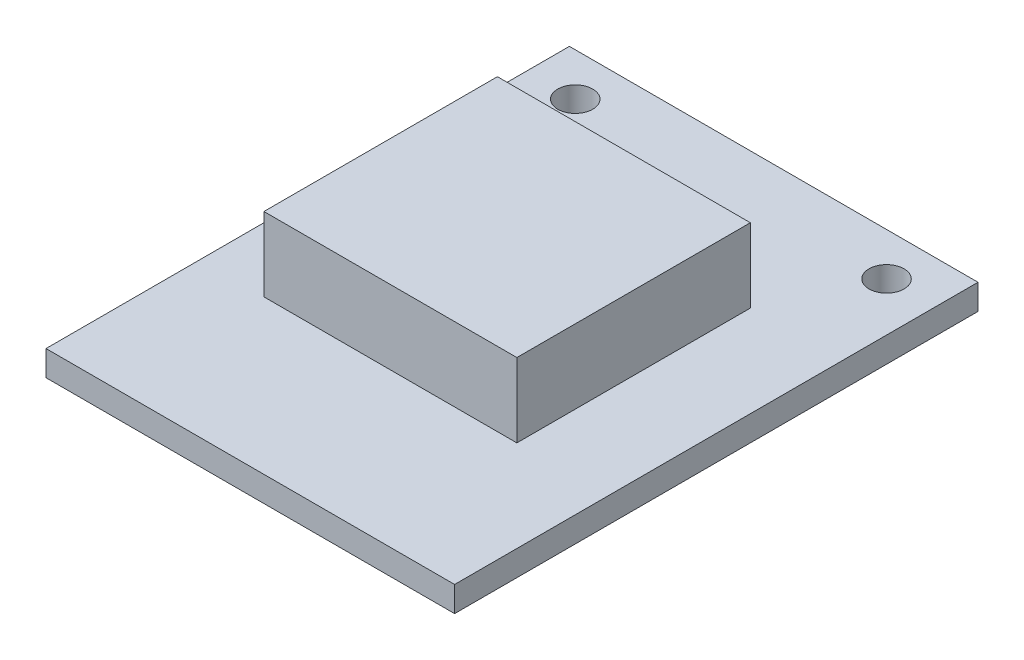
ISO-10303-21;
HEADER;
FILE_DESCRIPTION(('STEP AP214'),'2;1');
FILE_NAME('part.step','',(''),(''),'','','');
FILE_SCHEMA(('AUTOMOTIVE_DESIGN { 1 0 10303 214 1 1 1 1 }'));
ENDSEC;
DATA;
#1=APPLICATION_CONTEXT('core data for automotive mechanical design processes');
#2=APPLICATION_PROTOCOL_DEFINITION('international standard','automotive_design',2000,#1);
#3=PRODUCT_CONTEXT('',#1,'mechanical');
#4=PRODUCT('Part','Part','',(#3));
#5=PRODUCT_RELATED_PRODUCT_CATEGORY('part','',(#4));
#6=PRODUCT_DEFINITION_FORMATION('','',#4);
#7=PRODUCT_DEFINITION_CONTEXT('part definition',#1,'design');
#8=PRODUCT_DEFINITION('design','',#6,#7);
#9=PRODUCT_DEFINITION_SHAPE('','',#8);
#10=(LENGTH_UNIT() NAMED_UNIT(*) SI_UNIT(.MILLI.,.METRE.));
#11=(NAMED_UNIT(*) PLANE_ANGLE_UNIT() SI_UNIT($,.RADIAN.));
#12=(NAMED_UNIT(*) SI_UNIT($,.STERADIAN.) SOLID_ANGLE_UNIT());
#13=UNCERTAINTY_MEASURE_WITH_UNIT(LENGTH_MEASURE(1.E-05),#10,'distance_accuracy_value','');
#14=(GEOMETRIC_REPRESENTATION_CONTEXT(3) GLOBAL_UNCERTAINTY_ASSIGNED_CONTEXT((#13)) GLOBAL_UNIT_ASSIGNED_CONTEXT((#10,
#11,#12)) REPRESENTATION_CONTEXT('',''));
#15=CARTESIAN_POINT('',(0.,0.,0.));
#16=DIRECTION('',(0.,0.,1.));
#17=DIRECTION('',(1.,0.,0.));
#18=AXIS2_PLACEMENT_3D('',#15,#16,#17);
#19=CARTESIAN_POINT('',(0.,1.651,0.));
#20=DIRECTION('',(0.,1.,0.));
#21=DIRECTION('',(0.,0.,1.));
#22=AXIS2_PLACEMENT_3D('',#19,#20,#21);
#23=PLANE('',#22);
#24=DIRECTION('',(0.,0.,1.));
#25=VECTOR('',#24,1.);
#26=CARTESIAN_POINT('',(17.526,1.651,0.));
#27=LINE('',#26,#25);
#28=CARTESIAN_POINT('',(17.526,1.651,6.096));
#29=VERTEX_POINT('',#28);
#30=CARTESIAN_POINT('',(17.526,1.651,21.336));
#31=VERTEX_POINT('',#30);
#32=EDGE_CURVE('E132',#29,#31,#27,.T.);
#33=ORIENTED_EDGE('',*,*,#32,.T.);
#34=DIRECTION('',(1.,0.,0.));
#35=VECTOR('',#34,1.);
#36=CARTESIAN_POINT('',(0.,1.651,21.336));
#37=LINE('',#36,#35);
#38=CARTESIAN_POINT('',(1.016,1.651,21.336));
#39=VERTEX_POINT('',#38);
#40=EDGE_CURVE('E146',#39,#31,#37,.T.);
#41=ORIENTED_EDGE('',*,*,#40,.F.);
#42=DIRECTION('',(0.,0.,1.));
#43=VECTOR('',#42,1.);
#44=CARTESIAN_POINT('',(1.016,1.651,0.));
#45=LINE('',#44,#43);
#46=CARTESIAN_POINT('',(1.016,1.651,6.096));
#47=VERTEX_POINT('',#46);
#48=EDGE_CURVE('E159',#47,#39,#45,.T.);
#49=ORIENTED_EDGE('',*,*,#48,.F.);
#50=DIRECTION('',(1.,0.,0.));
#51=VECTOR('',#50,1.);
#52=CARTESIAN_POINT('',(0.,1.651,6.096));
#53=LINE('',#52,#51);
#54=EDGE_CURVE('E157',#47,#29,#53,.T.);
#55=ORIENTED_EDGE('',*,*,#54,.T.);
#56=EDGE_LOOP('',(#33,#41,#49,#55));
#57=FACE_BOUND('',#56,.T.);
#58=CARTESIAN_POINT('',(0.,1.651,0.));
#59=DIRECTION('',(0.,1.,0.));
#60=DIRECTION('',(0.,0.,1.));
#61=AXIS2_PLACEMENT_3D('',#58,#59,#60);
#62=CIRCLE('',#61,1.143);
#63=CARTESIAN_POINT('',(0.,1.651,1.143));
#64=VERTEX_POINT('',#63);
#65=EDGE_CURVE('E171',#64,#64,#62,.T.);
#66=ORIENTED_EDGE('',*,*,#65,.F.);
#67=EDGE_LOOP('',(#66));
#68=FACE_BOUND('',#67,.T.);
#69=DIRECTION('',(0.,0.,1.));
#70=VECTOR('',#69,1.);
#71=CARTESIAN_POINT('',(-3.175,1.651,-2.794));
#72=LINE('',#71,#70);
#73=CARTESIAN_POINT('',(-3.175,1.651,-2.794));
#74=VERTEX_POINT('',#73);
#75=CARTESIAN_POINT('',(-3.17499999999999,1.651,31.369));
#76=VERTEX_POINT('',#75);
#77=EDGE_CURVE('E177',#74,#76,#72,.T.);
#78=ORIENTED_EDGE('',*,*,#77,.T.);
#79=DIRECTION('',(1.,0.,0.));
#80=VECTOR('',#79,1.);
#81=CARTESIAN_POINT('',(-3.17499999999999,1.651,31.369));
#82=LINE('',#81,#80);
#83=CARTESIAN_POINT('',(23.495,1.651,31.369));
#84=VERTEX_POINT('',#83);
#85=EDGE_CURVE('E103',#76,#84,#82,.T.);
#86=ORIENTED_EDGE('',*,*,#85,.T.);
#87=DIRECTION('',(0.,0.,-1.));
#88=VECTOR('',#87,1.);
#89=CARTESIAN_POINT('',(23.495,1.651,-2.794));
#90=LINE('',#89,#88);
#91=CARTESIAN_POINT('',(23.495,1.651,-2.794));
#92=VERTEX_POINT('',#91);
#93=EDGE_CURVE('E180',#84,#92,#90,.T.);
#94=ORIENTED_EDGE('',*,*,#93,.T.);
#95=DIRECTION('',(-1.,0.,0.));
#96=VECTOR('',#95,1.);
#97=CARTESIAN_POINT('',(-3.175,1.651,-2.794));
#98=LINE('',#97,#96);
#99=EDGE_CURVE('E75',#92,#74,#98,.T.);
#100=ORIENTED_EDGE('',*,*,#99,.T.);
#101=EDGE_LOOP('',(#78,#86,#94,#100));
#102=FACE_BOUND('',#101,.T.);
#103=CARTESIAN_POINT('',(20.32,1.651,0.));
#104=DIRECTION('',(0.,1.,0.));
#105=DIRECTION('',(0.,0.,1.));
#106=AXIS2_PLACEMENT_3D('',#103,#104,#105);
#107=CIRCLE('',#106,1.143);
#108=CARTESIAN_POINT('',(20.32,1.651,1.143));
#109=VERTEX_POINT('',#108);
#110=EDGE_CURVE('E165',#109,#109,#107,.T.);
#111=ORIENTED_EDGE('',*,*,#110,.F.);
#112=EDGE_LOOP('',(#111));
#113=FACE_BOUND('',#112,.T.);
#114=ADVANCED_FACE('F51',(#57,#68,#102,#113),#23,.T.);
#115=CARTESIAN_POINT('',(0.,0.,0.));
#116=DIRECTION('',(0.,1.,0.));
#117=DIRECTION('',(0.,0.,1.));
#118=AXIS2_PLACEMENT_3D('',#115,#116,#117);
#119=PLANE('',#118);
#120=DIRECTION('',(0.,0.,1.));
#121=VECTOR('',#120,1.);
#122=CARTESIAN_POINT('',(-3.175,0.,-2.794));
#123=LINE('',#122,#121);
#124=CARTESIAN_POINT('',(-3.175,0.,-2.794));
#125=VERTEX_POINT('',#124);
#126=CARTESIAN_POINT('',(-3.17499999999999,0.,31.369));
#127=VERTEX_POINT('',#126);
#128=EDGE_CURVE('E174',#125,#127,#123,.T.);
#129=ORIENTED_EDGE('',*,*,#128,.F.);
#130=DIRECTION('',(-1.,0.,0.));
#131=VECTOR('',#130,1.);
#132=CARTESIAN_POINT('',(-3.175,0.,-2.794));
#133=LINE('',#132,#131);
#134=CARTESIAN_POINT('',(23.495,0.,-2.794));
#135=VERTEX_POINT('',#134);
#136=EDGE_CURVE('E96',#135,#125,#133,.T.);
#137=ORIENTED_EDGE('',*,*,#136,.F.);
#138=DIRECTION('',(0.,0.,-1.));
#139=VECTOR('',#138,1.);
#140=CARTESIAN_POINT('',(23.495,0.,-2.794));
#141=LINE('',#140,#139);
#142=CARTESIAN_POINT('',(23.495,0.,31.369));
#143=VERTEX_POINT('',#142);
#144=EDGE_CURVE('E188',#143,#135,#141,.T.);
#145=ORIENTED_EDGE('',*,*,#144,.F.);
#146=DIRECTION('',(1.,0.,0.));
#147=VECTOR('',#146,1.);
#148=CARTESIAN_POINT('',(-3.17499999999999,0.,31.369));
#149=LINE('',#148,#147);
#150=EDGE_CURVE('E186',#127,#143,#149,.T.);
#151=ORIENTED_EDGE('',*,*,#150,.F.);
#152=EDGE_LOOP('',(#129,#137,#145,#151));
#153=FACE_BOUND('',#152,.T.);
#154=CARTESIAN_POINT('',(0.,0.,0.));
#155=DIRECTION('',(0.,1.,0.));
#156=DIRECTION('',(0.,0.,1.));
#157=AXIS2_PLACEMENT_3D('',#154,#155,#156);
#158=CIRCLE('',#157,1.143);
#159=CARTESIAN_POINT('',(0.,0.,1.143));
#160=VERTEX_POINT('',#159);
#161=EDGE_CURVE('E168',#160,#160,#158,.T.);
#162=ORIENTED_EDGE('',*,*,#161,.T.);
#163=EDGE_LOOP('',(#162));
#164=FACE_BOUND('',#163,.T.);
#165=CARTESIAN_POINT('',(20.32,0.,0.));
#166=DIRECTION('',(0.,1.,0.));
#167=DIRECTION('',(0.,0.,1.));
#168=AXIS2_PLACEMENT_3D('',#165,#166,#167);
#169=CIRCLE('',#168,1.143);
#170=CARTESIAN_POINT('',(20.32,0.,1.143));
#171=VERTEX_POINT('',#170);
#172=EDGE_CURVE('E137',#171,#171,#169,.T.);
#173=ORIENTED_EDGE('',*,*,#172,.T.);
#174=EDGE_LOOP('',(#173));
#175=FACE_BOUND('',#174,.T.);
#176=ADVANCED_FACE('F201',(#153,#164,#175),#119,.F.);
#177=CARTESIAN_POINT('',(-3.175,1.651,-2.794));
#178=DIRECTION('',(1.,0.,0.));
#179=DIRECTION('',(0.,0.,-1.));
#180=AXIS2_PLACEMENT_3D('',#177,#178,#179);
#181=PLANE('',#180);
#182=ORIENTED_EDGE('',*,*,#128,.T.);
#183=DIRECTION('',(0.,-1.,0.));
#184=VECTOR('',#183,1.);
#185=CARTESIAN_POINT('',(-3.17499999999999,1.651,31.369));
#186=LINE('',#185,#184);
#187=EDGE_CURVE('E11',#76,#127,#186,.T.);
#188=ORIENTED_EDGE('',*,*,#187,.F.);
#189=ORIENTED_EDGE('',*,*,#77,.F.);
#190=DIRECTION('',(0.,-1.,0.));
#191=VECTOR('',#190,1.);
#192=CARTESIAN_POINT('',(-3.175,1.651,-2.794));
#193=LINE('',#192,#191);
#194=EDGE_CURVE('E183',#74,#125,#193,.T.);
#195=ORIENTED_EDGE('',*,*,#194,.T.);
#196=EDGE_LOOP('',(#182,#188,#189,#195));
#197=FACE_BOUND('',#196,.T.);
#198=ADVANCED_FACE('F53',(#197),#181,.F.);
#199=CARTESIAN_POINT('',(-3.17499999999999,1.651,31.369));
#200=DIRECTION('',(0.,0.,-1.));
#201=DIRECTION('',(-1.,0.,0.));
#202=AXIS2_PLACEMENT_3D('',#199,#200,#201);
#203=PLANE('',#202);
#204=ORIENTED_EDGE('',*,*,#150,.T.);
#205=DIRECTION('',(0.,-1.,0.));
#206=VECTOR('',#205,1.);
#207=CARTESIAN_POINT('',(23.495,1.651,31.369));
#208=LINE('',#207,#206);
#209=EDGE_CURVE('E59',#84,#143,#208,.T.);
#210=ORIENTED_EDGE('',*,*,#209,.F.);
#211=ORIENTED_EDGE('',*,*,#85,.F.);
#212=ORIENTED_EDGE('',*,*,#187,.T.);
#213=EDGE_LOOP('',(#204,#210,#211,#212));
#214=FACE_BOUND('',#213,.T.);
#215=ADVANCED_FACE('F217',(#214),#203,.F.);
#216=CARTESIAN_POINT('',(23.495,1.651,-2.794));
#217=DIRECTION('',(-1.,0.,0.));
#218=DIRECTION('',(0.,0.,1.));
#219=AXIS2_PLACEMENT_3D('',#216,#217,#218);
#220=PLANE('',#219);
#221=ORIENTED_EDGE('',*,*,#144,.T.);
#222=DIRECTION('',(0.,-1.,0.));
#223=VECTOR('',#222,1.);
#224=CARTESIAN_POINT('',(23.495,1.651,-2.794));
#225=LINE('',#224,#223);
#226=EDGE_CURVE('E192',#92,#135,#225,.T.);
#227=ORIENTED_EDGE('',*,*,#226,.F.);
#228=ORIENTED_EDGE('',*,*,#93,.F.);
#229=ORIENTED_EDGE('',*,*,#209,.T.);
#230=EDGE_LOOP('',(#221,#227,#228,#229));
#231=FACE_BOUND('',#230,.T.);
#232=ADVANCED_FACE('F197',(#231),#220,.F.);
#233=CARTESIAN_POINT('',(-3.175,1.651,-2.794));
#234=DIRECTION('',(0.,0.,1.));
#235=DIRECTION('',(1.,0.,0.));
#236=AXIS2_PLACEMENT_3D('',#233,#234,#235);
#237=PLANE('',#236);
#238=ORIENTED_EDGE('',*,*,#136,.T.);
#239=ORIENTED_EDGE('',*,*,#194,.F.);
#240=ORIENTED_EDGE('',*,*,#99,.F.);
#241=ORIENTED_EDGE('',*,*,#226,.T.);
#242=EDGE_LOOP('',(#238,#239,#240,#241));
#243=FACE_BOUND('',#242,.T.);
#244=ADVANCED_FACE('F206',(#243),#237,.F.);
#245=CARTESIAN_POINT('',(0.,1.651,0.));
#246=DIRECTION('',(0.,-1.,0.));
#247=DIRECTION('',(0.,0.,-1.));
#248=AXIS2_PLACEMENT_3D('',#245,#246,#247);
#249=CYLINDRICAL_SURFACE('',#248,1.143);
#250=ORIENTED_EDGE('',*,*,#65,.T.);
#251=EDGE_LOOP('',(#250));
#252=FACE_BOUND('',#251,.T.);
#253=ORIENTED_EDGE('',*,*,#161,.F.);
#254=EDGE_LOOP('',(#253));
#255=FACE_BOUND('',#254,.T.);
#256=ADVANCED_FACE('F208',(#252,#255),#249,.F.);
#257=CARTESIAN_POINT('',(20.32,1.651,0.));
#258=DIRECTION('',(0.,-1.,0.));
#259=DIRECTION('',(0.,0.,-1.));
#260=AXIS2_PLACEMENT_3D('',#257,#258,#259);
#261=CYLINDRICAL_SURFACE('',#260,1.143);
#262=ORIENTED_EDGE('',*,*,#110,.T.);
#263=EDGE_LOOP('',(#262));
#264=FACE_BOUND('',#263,.T.);
#265=ORIENTED_EDGE('',*,*,#172,.F.);
#266=EDGE_LOOP('',(#265));
#267=FACE_BOUND('',#266,.T.);
#268=ADVANCED_FACE('F214',(#264,#267),#261,.F.);
#269=CARTESIAN_POINT('',(17.526,6.477,0.));
#270=DIRECTION('',(1.,0.,0.));
#271=DIRECTION('',(0.,0.,-1.));
#272=AXIS2_PLACEMENT_3D('',#269,#270,#271);
#273=PLANE('',#272);
#274=ORIENTED_EDGE('',*,*,#32,.F.);
#275=DIRECTION('',(0.,-1.,0.));
#276=VECTOR('',#275,1.);
#277=CARTESIAN_POINT('',(17.526,6.477,6.096));
#278=LINE('',#277,#276);
#279=CARTESIAN_POINT('',(17.526,6.477,6.096));
#280=VERTEX_POINT('',#279);
#281=EDGE_CURVE('E127',#280,#29,#278,.T.);
#282=ORIENTED_EDGE('',*,*,#281,.F.);
#283=DIRECTION('',(0.,0.,1.));
#284=VECTOR('',#283,1.);
#285=CARTESIAN_POINT('',(17.526,6.477,0.));
#286=LINE('',#285,#284);
#287=CARTESIAN_POINT('',(17.526,6.477,21.336));
#288=VERTEX_POINT('',#287);
#289=EDGE_CURVE('E130',#280,#288,#286,.T.);
#290=ORIENTED_EDGE('',*,*,#289,.T.);
#291=DIRECTION('',(0.,-1.,0.));
#292=VECTOR('',#291,1.);
#293=CARTESIAN_POINT('',(17.526,6.477,21.336));
#294=LINE('',#293,#292);
#295=EDGE_CURVE('E155',#288,#31,#294,.T.);
#296=ORIENTED_EDGE('',*,*,#295,.T.);
#297=EDGE_LOOP('',(#274,#282,#290,#296));
#298=FACE_BOUND('',#297,.T.);
#299=ADVANCED_FACE('F129',(#298),#273,.T.);
#300=CARTESIAN_POINT('',(0.,6.477,6.096));
#301=DIRECTION('',(0.,0.,-1.));
#302=DIRECTION('',(-1.,0.,0.));
#303=AXIS2_PLACEMENT_3D('',#300,#301,#302);
#304=PLANE('',#303);
#305=ORIENTED_EDGE('',*,*,#54,.F.);
#306=DIRECTION('',(0.,-1.,0.));
#307=VECTOR('',#306,1.);
#308=CARTESIAN_POINT('',(1.016,6.477,6.096));
#309=LINE('',#308,#307);
#310=CARTESIAN_POINT('',(1.016,6.477,6.096));
#311=VERTEX_POINT('',#310);
#312=EDGE_CURVE('E138',#311,#47,#309,.T.);
#313=ORIENTED_EDGE('',*,*,#312,.F.);
#314=DIRECTION('',(1.,0.,0.));
#315=VECTOR('',#314,1.);
#316=CARTESIAN_POINT('',(0.,6.477,6.096));
#317=LINE('',#316,#315);
#318=EDGE_CURVE('E143',#311,#280,#317,.T.);
#319=ORIENTED_EDGE('',*,*,#318,.T.);
#320=ORIENTED_EDGE('',*,*,#281,.T.);
#321=EDGE_LOOP('',(#305,#313,#319,#320));
#322=FACE_BOUND('',#321,.T.);
#323=ADVANCED_FACE('F148',(#322),#304,.T.);
#324=CARTESIAN_POINT('',(1.016,6.477,0.));
#325=DIRECTION('',(1.,0.,0.));
#326=DIRECTION('',(0.,0.,-1.));
#327=AXIS2_PLACEMENT_3D('',#324,#325,#326);
#328=PLANE('',#327);
#329=ORIENTED_EDGE('',*,*,#48,.T.);
#330=DIRECTION('',(0.,-1.,0.));
#331=VECTOR('',#330,1.);
#332=CARTESIAN_POINT('',(1.016,6.477,21.336));
#333=LINE('',#332,#331);
#334=CARTESIAN_POINT('',(1.016,6.477,21.336));
#335=VERTEX_POINT('',#334);
#336=EDGE_CURVE('E66',#335,#39,#333,.T.);
#337=ORIENTED_EDGE('',*,*,#336,.F.);
#338=DIRECTION('',(0.,0.,1.));
#339=VECTOR('',#338,1.);
#340=CARTESIAN_POINT('',(1.016,6.477,0.));
#341=LINE('',#340,#339);
#342=EDGE_CURVE('E150',#311,#335,#341,.T.);
#343=ORIENTED_EDGE('',*,*,#342,.F.);
#344=ORIENTED_EDGE('',*,*,#312,.T.);
#345=EDGE_LOOP('',(#329,#337,#343,#344));
#346=FACE_BOUND('',#345,.T.);
#347=ADVANCED_FACE('F235',(#346),#328,.F.);
#348=CARTESIAN_POINT('',(0.,6.477,21.336));
#349=DIRECTION('',(0.,0.,-1.));
#350=DIRECTION('',(-1.,0.,0.));
#351=AXIS2_PLACEMENT_3D('',#348,#349,#350);
#352=PLANE('',#351);
#353=ORIENTED_EDGE('',*,*,#40,.T.);
#354=ORIENTED_EDGE('',*,*,#295,.F.);
#355=DIRECTION('',(1.,0.,0.));
#356=VECTOR('',#355,1.);
#357=CARTESIAN_POINT('',(0.,6.477,21.336));
#358=LINE('',#357,#356);
#359=EDGE_CURVE('E144',#335,#288,#358,.T.);
#360=ORIENTED_EDGE('',*,*,#359,.F.);
#361=ORIENTED_EDGE('',*,*,#336,.T.);
#362=EDGE_LOOP('',(#353,#354,#360,#361));
#363=FACE_BOUND('',#362,.T.);
#364=ADVANCED_FACE('F238',(#363),#352,.F.);
#365=CARTESIAN_POINT('',(0.,6.477,0.));
#366=DIRECTION('',(0.,1.,0.));
#367=DIRECTION('',(0.,0.,1.));
#368=AXIS2_PLACEMENT_3D('',#365,#366,#367);
#369=PLANE('',#368);
#370=ORIENTED_EDGE('',*,*,#289,.F.);
#371=ORIENTED_EDGE('',*,*,#318,.F.);
#372=ORIENTED_EDGE('',*,*,#342,.T.);
#373=ORIENTED_EDGE('',*,*,#359,.T.);
#374=EDGE_LOOP('',(#370,#371,#372,#373));
#375=FACE_BOUND('',#374,.T.);
#376=ADVANCED_FACE('F142',(#375),#369,.T.);
#377=CLOSED_SHELL('',(#114,#176,#198,#215,#232,#244,#256,#268,#299,#323,#347,#364,#376));
#378=MANIFOLD_SOLID_BREP('B2',#377);
#379=ADVANCED_BREP_SHAPE_REPRESENTATION('',(#18,#378),#14);
#380=SHAPE_DEFINITION_REPRESENTATION(#9,#379);
ENDSEC;
END-ISO-10303-21;
